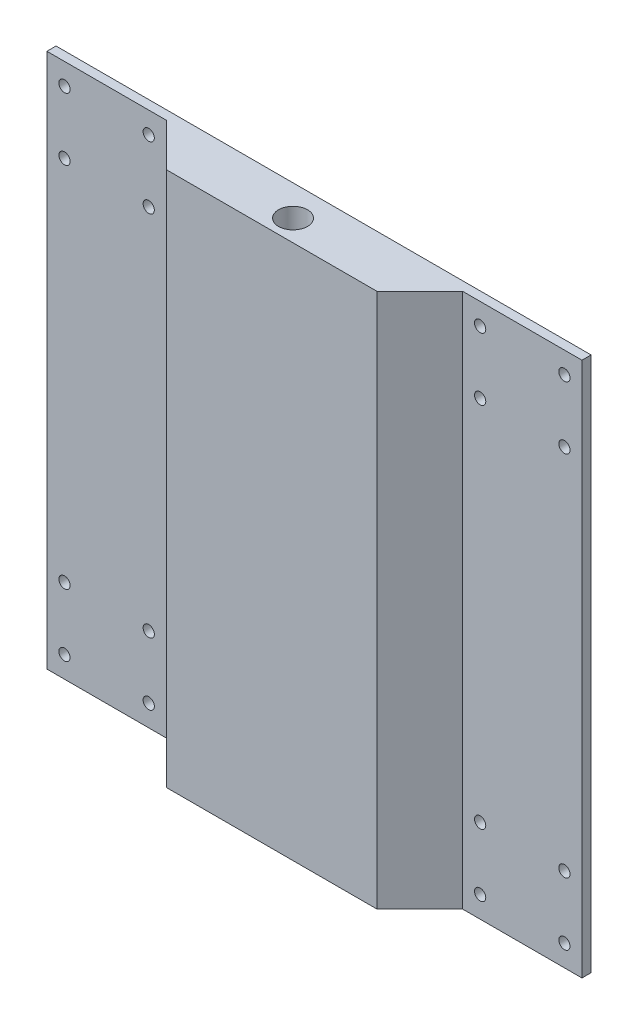
ISO-10303-21;
HEADER;
FILE_DESCRIPTION(('STEP AP214'),'2;1');
FILE_NAME('part.step','',(''),(''),'','','');
FILE_SCHEMA(('AUTOMOTIVE_DESIGN { 1 0 10303 214 1 1 1 1 }'));
ENDSEC;
DATA;
#1=APPLICATION_CONTEXT('core data for automotive mechanical design processes');
#2=APPLICATION_PROTOCOL_DEFINITION('international standard','automotive_design',2000,#1);
#3=PRODUCT_CONTEXT('',#1,'mechanical');
#4=PRODUCT('Part','Part','',(#3));
#5=PRODUCT_RELATED_PRODUCT_CATEGORY('part','',(#4));
#6=PRODUCT_DEFINITION_FORMATION('','',#4);
#7=PRODUCT_DEFINITION_CONTEXT('part definition',#1,'design');
#8=PRODUCT_DEFINITION('design','',#6,#7);
#9=PRODUCT_DEFINITION_SHAPE('','',#8);
#10=(LENGTH_UNIT() NAMED_UNIT(*) SI_UNIT(.MILLI.,.METRE.));
#11=(NAMED_UNIT(*) PLANE_ANGLE_UNIT() SI_UNIT($,.RADIAN.));
#12=(NAMED_UNIT(*) SI_UNIT($,.STERADIAN.) SOLID_ANGLE_UNIT());
#13=UNCERTAINTY_MEASURE_WITH_UNIT(LENGTH_MEASURE(1.E-05),#10,'distance_accuracy_value','');
#14=(GEOMETRIC_REPRESENTATION_CONTEXT(3) GLOBAL_UNCERTAINTY_ASSIGNED_CONTEXT((#13)) GLOBAL_UNIT_ASSIGNED_CONTEXT((#10,
#11,#12)) REPRESENTATION_CONTEXT('',''));
#15=CARTESIAN_POINT('',(0.,0.,0.));
#16=DIRECTION('',(0.,0.,1.));
#17=DIRECTION('',(1.,0.,0.));
#18=AXIS2_PLACEMENT_3D('',#15,#16,#17);
#19=CARTESIAN_POINT('',(0.,0.,2.6));
#20=DIRECTION('',(0.,0.,-1.));
#21=DIRECTION('',(-1.,0.,0.));
#22=AXIS2_PLACEMENT_3D('',#19,#20,#21);
#23=PLANE('',#22);
#24=CARTESIAN_POINT('',(147.4,128.5,2.6));
#25=DIRECTION('',(0.,0.,1.));
#26=DIRECTION('',(1.,0.,0.));
#27=AXIS2_PLACEMENT_3D('',#24,#25,#26);
#28=CIRCLE('',#27,1.59999999999999);
#29=CARTESIAN_POINT('',(149.,128.5,2.6));
#30=VERTEX_POINT('',#29);
#31=EDGE_CURVE('E286',#30,#30,#28,.T.);
#32=ORIENTED_EDGE('',*,*,#31,.F.);
#33=EDGE_LOOP('',(#32));
#34=FACE_BOUND('',#33,.T.);
#35=CARTESIAN_POINT('',(147.4,146.3,2.6));
#36=DIRECTION('',(0.,0.,-1.));
#37=DIRECTION('',(-1.,0.,0.));
#38=AXIS2_PLACEMENT_3D('',#35,#36,#37);
#39=CIRCLE('',#38,1.59999999999999);
#40=CARTESIAN_POINT('',(145.8,146.3,2.6));
#41=VERTEX_POINT('',#40);
#42=EDGE_CURVE('E254',#41,#41,#39,.T.);
#43=ORIENTED_EDGE('',*,*,#42,.T.);
#44=EDGE_LOOP('',(#43));
#45=FACE_BOUND('',#44,.T.);
#46=CARTESIAN_POINT('',(147.4,6.09999999999999,2.6));
#47=DIRECTION('',(0.,0.,1.));
#48=DIRECTION('',(1.,0.,0.));
#49=AXIS2_PLACEMENT_3D('',#46,#47,#48);
#50=CIRCLE('',#49,1.59999999999999);
#51=CARTESIAN_POINT('',(149.,6.09999999999999,2.6));
#52=VERTEX_POINT('',#51);
#53=EDGE_CURVE('E318',#52,#52,#50,.T.);
#54=ORIENTED_EDGE('',*,*,#53,.F.);
#55=EDGE_LOOP('',(#54));
#56=FACE_BOUND('',#55,.T.);
#57=CARTESIAN_POINT('',(147.4,23.8999999999999,2.6));
#58=DIRECTION('',(0.,0.,-1.));
#59=DIRECTION('',(-1.,0.,0.));
#60=AXIS2_PLACEMENT_3D('',#57,#58,#59);
#61=CIRCLE('',#60,1.59999999999999);
#62=CARTESIAN_POINT('',(145.8,23.8999999999999,2.6));
#63=VERTEX_POINT('',#62);
#64=EDGE_CURVE('E270',#63,#63,#61,.T.);
#65=ORIENTED_EDGE('',*,*,#64,.T.);
#66=EDGE_LOOP('',(#65));
#67=FACE_BOUND('',#66,.T.);
#68=DIRECTION('',(0.,1.,0.));
#69=VECTOR('',#68,1.);
#70=CARTESIAN_POINT('',(118.4,0.,2.6));
#71=LINE('',#70,#69);
#72=CARTESIAN_POINT('',(118.4,0.,2.6));
#73=VERTEX_POINT('',#72);
#74=CARTESIAN_POINT('',(118.4,152.4,2.6));
#75=VERTEX_POINT('',#74);
#76=EDGE_CURVE('E156',#73,#75,#71,.T.);
#77=ORIENTED_EDGE('',*,*,#76,.F.);
#78=DIRECTION('',(1.,0.,0.));
#79=VECTOR('',#78,1.);
#80=CARTESIAN_POINT('',(0.,0.,2.6));
#81=LINE('',#80,#79);
#82=CARTESIAN_POINT('',(152.4,0.,2.6));
#83=VERTEX_POINT('',#82);
#84=EDGE_CURVE('E139',#73,#83,#81,.T.);
#85=ORIENTED_EDGE('',*,*,#84,.T.);
#86=DIRECTION('',(0.,1.,0.));
#87=VECTOR('',#86,1.);
#88=CARTESIAN_POINT('',(152.4,0.,2.6));
#89=LINE('',#88,#87);
#90=CARTESIAN_POINT('',(152.4,152.4,2.6));
#91=VERTEX_POINT('',#90);
#92=EDGE_CURVE('E138',#83,#91,#89,.T.);
#93=ORIENTED_EDGE('',*,*,#92,.T.);
#94=DIRECTION('',(-1.,0.,0.));
#95=VECTOR('',#94,1.);
#96=CARTESIAN_POINT('',(0.,152.4,2.6));
#97=LINE('',#96,#95);
#98=EDGE_CURVE('E146',#91,#75,#97,.T.);
#99=ORIENTED_EDGE('',*,*,#98,.T.);
#100=EDGE_LOOP('',(#77,#85,#93,#99));
#101=FACE_BOUND('',#100,.T.);
#102=CARTESIAN_POINT('',(123.4,6.09999999999999,2.6));
#103=DIRECTION('',(0.,0.,-1.));
#104=DIRECTION('',(-1.,0.,0.));
#105=AXIS2_PLACEMENT_3D('',#102,#103,#104);
#106=CIRCLE('',#105,1.59999999999999);
#107=CARTESIAN_POINT('',(121.8,6.09999999999999,2.6));
#108=VERTEX_POINT('',#107);
#109=EDGE_CURVE('E310',#108,#108,#106,.T.);
#110=ORIENTED_EDGE('',*,*,#109,.T.);
#111=EDGE_LOOP('',(#110));
#112=FACE_BOUND('',#111,.T.);
#113=CARTESIAN_POINT('',(123.4,146.3,2.6));
#114=DIRECTION('',(0.,0.,1.));
#115=DIRECTION('',(1.,0.,0.));
#116=AXIS2_PLACEMENT_3D('',#113,#114,#115);
#117=CIRCLE('',#116,1.59999999999999);
#118=CARTESIAN_POINT('',(125.,146.3,2.6));
#119=VERTEX_POINT('',#118);
#120=EDGE_CURVE('E253',#119,#119,#117,.T.);
#121=ORIENTED_EDGE('',*,*,#120,.F.);
#122=EDGE_LOOP('',(#121));
#123=FACE_BOUND('',#122,.T.);
#124=CARTESIAN_POINT('',(123.4,128.5,2.6));
#125=DIRECTION('',(0.,0.,-1.));
#126=DIRECTION('',(-1.,0.,0.));
#127=AXIS2_PLACEMENT_3D('',#124,#125,#126);
#128=CIRCLE('',#127,1.59999999999999);
#129=CARTESIAN_POINT('',(121.8,128.5,2.6));
#130=VERTEX_POINT('',#129);
#131=EDGE_CURVE('E278',#130,#130,#128,.T.);
#132=ORIENTED_EDGE('',*,*,#131,.T.);
#133=EDGE_LOOP('',(#132));
#134=FACE_BOUND('',#133,.T.);
#135=CARTESIAN_POINT('',(123.4,23.9,2.6));
#136=DIRECTION('',(0.,0.,1.));
#137=DIRECTION('',(1.,0.,0.));
#138=AXIS2_PLACEMENT_3D('',#135,#136,#137);
#139=CIRCLE('',#138,1.59999999999998);
#140=CARTESIAN_POINT('',(125.,23.9,2.6));
#141=VERTEX_POINT('',#140);
#142=EDGE_CURVE('E269',#141,#141,#139,.T.);
#143=ORIENTED_EDGE('',*,*,#142,.F.);
#144=EDGE_LOOP('',(#143));
#145=FACE_BOUND('',#144,.T.);
#146=ADVANCED_FACE('F43',(#34,#45,#56,#67,#101,#112,#123,#134,#145),#23,.F.);
#147=CARTESIAN_POINT('',(29.,146.3,2.6));
#148=DIRECTION('',(0.,0.,1.));
#149=DIRECTION('',(1.,0.,0.));
#150=AXIS2_PLACEMENT_3D('',#147,#148,#149);
#151=CIRCLE('',#150,1.59999999999999);
#152=CARTESIAN_POINT('',(30.6,146.3,2.6));
#153=VERTEX_POINT('',#152);
#154=EDGE_CURVE('E229',#153,#153,#151,.F.);
#155=ORIENTED_EDGE('',*,*,#154,.T.);
#156=EDGE_LOOP('',(#155));
#157=FACE_BOUND('',#156,.T.);
#158=CARTESIAN_POINT('',(29.,128.5,2.6));
#159=DIRECTION('',(0.,0.,1.));
#160=DIRECTION('',(1.,0.,0.));
#161=AXIS2_PLACEMENT_3D('',#158,#159,#160);
#162=CIRCLE('',#161,1.59999999999999);
#163=CARTESIAN_POINT('',(30.6,128.5,2.6));
#164=VERTEX_POINT('',#163);
#165=EDGE_CURVE('E238',#164,#164,#162,.T.);
#166=ORIENTED_EDGE('',*,*,#165,.F.);
#167=EDGE_LOOP('',(#166));
#168=FACE_BOUND('',#167,.T.);
#169=CARTESIAN_POINT('',(4.99999999999995,6.10000000000005,2.6));
#170=DIRECTION('',(0.,0.,-1.));
#171=DIRECTION('',(-1.,0.,0.));
#172=AXIS2_PLACEMENT_3D('',#169,#170,#171);
#173=CIRCLE('',#172,1.59999999999999);
#174=CARTESIAN_POINT('',(3.39999999999996,6.10000000000005,2.6));
#175=VERTEX_POINT('',#174);
#176=EDGE_CURVE('E333',#175,#175,#173,.T.);
#177=ORIENTED_EDGE('',*,*,#176,.T.);
#178=EDGE_LOOP('',(#177));
#179=FACE_BOUND('',#178,.T.);
#180=CARTESIAN_POINT('',(4.99999999999996,23.9,2.6));
#181=DIRECTION('',(0.,0.,1.));
#182=DIRECTION('',(1.,0.,0.));
#183=AXIS2_PLACEMENT_3D('',#180,#181,#182);
#184=CIRCLE('',#183,1.59999999999999);
#185=CARTESIAN_POINT('',(6.59999999999995,23.9,2.6));
#186=VERTEX_POINT('',#185);
#187=EDGE_CURVE('E301',#186,#186,#184,.T.);
#188=ORIENTED_EDGE('',*,*,#187,.F.);
#189=EDGE_LOOP('',(#188));
#190=FACE_BOUND('',#189,.T.);
#191=CARTESIAN_POINT('',(5.,128.5,2.6));
#192=DIRECTION('',(0.,0.,1.));
#193=DIRECTION('',(1.,0.,0.));
#194=AXIS2_PLACEMENT_3D('',#191,#192,#193);
#195=CIRCLE('',#194,1.59999999999999);
#196=CARTESIAN_POINT('',(6.59999999999999,128.5,2.6));
#197=VERTEX_POINT('',#196);
#198=EDGE_CURVE('E225',#197,#197,#195,.F.);
#199=ORIENTED_EDGE('',*,*,#198,.T.);
#200=EDGE_LOOP('',(#199));
#201=FACE_BOUND('',#200,.T.);
#202=CARTESIAN_POINT('',(0.,0.,2.6));
#203=VERTEX_POINT('',#202);
#204=CARTESIAN_POINT('',(34.,0.,2.6));
#205=VERTEX_POINT('',#204);
#206=EDGE_CURVE('E96',#203,#205,#81,.T.);
#207=ORIENTED_EDGE('',*,*,#206,.T.);
#208=DIRECTION('',(0.,1.,0.));
#209=VECTOR('',#208,1.);
#210=CARTESIAN_POINT('',(34.,0.,2.6));
#211=LINE('',#210,#209);
#212=CARTESIAN_POINT('',(34.,152.4,2.6));
#213=VERTEX_POINT('',#212);
#214=EDGE_CURVE('E117',#205,#213,#211,.T.);
#215=ORIENTED_EDGE('',*,*,#214,.T.);
#216=CARTESIAN_POINT('',(0.,152.4,2.6));
#217=VERTEX_POINT('',#216);
#218=EDGE_CURVE('E67',#213,#217,#97,.T.);
#219=ORIENTED_EDGE('',*,*,#218,.T.);
#220=DIRECTION('',(0.,-1.,0.));
#221=VECTOR('',#220,1.);
#222=CARTESIAN_POINT('',(0.,0.,2.6));
#223=LINE('',#222,#221);
#224=EDGE_CURVE('E135',#217,#203,#223,.T.);
#225=ORIENTED_EDGE('',*,*,#224,.T.);
#226=EDGE_LOOP('',(#207,#215,#219,#225));
#227=FACE_BOUND('',#226,.T.);
#228=CARTESIAN_POINT('',(29.,23.9,2.6));
#229=DIRECTION('',(0.,0.,-1.));
#230=DIRECTION('',(-1.,0.,0.));
#231=AXIS2_PLACEMENT_3D('',#228,#229,#230);
#232=CIRCLE('',#231,1.6);
#233=CARTESIAN_POINT('',(27.4,23.9,2.6));
#234=VERTEX_POINT('',#233);
#235=EDGE_CURVE('E302',#234,#234,#232,.T.);
#236=ORIENTED_EDGE('',*,*,#235,.T.);
#237=EDGE_LOOP('',(#236));
#238=FACE_BOUND('',#237,.T.);
#239=CARTESIAN_POINT('',(28.9999999999999,6.10000000000002,2.6));
#240=DIRECTION('',(0.,0.,1.));
#241=DIRECTION('',(1.,0.,0.));
#242=AXIS2_PLACEMENT_3D('',#239,#240,#241);
#243=CIRCLE('',#242,1.59999999999999);
#244=CARTESIAN_POINT('',(30.5999999999999,6.10000000000002,2.6));
#245=VERTEX_POINT('',#244);
#246=EDGE_CURVE('E341',#245,#245,#243,.T.);
#247=ORIENTED_EDGE('',*,*,#246,.F.);
#248=EDGE_LOOP('',(#247));
#249=FACE_BOUND('',#248,.T.);
#250=CARTESIAN_POINT('',(5.,146.3,2.6));
#251=DIRECTION('',(0.,0.,1.));
#252=DIRECTION('',(1.,0.,0.));
#253=AXIS2_PLACEMENT_3D('',#250,#251,#252);
#254=CIRCLE('',#253,1.59999999999999);
#255=CARTESIAN_POINT('',(6.59999999999999,146.3,2.6));
#256=VERTEX_POINT('',#255);
#257=EDGE_CURVE('E237',#256,#256,#254,.T.);
#258=ORIENTED_EDGE('',*,*,#257,.F.);
#259=EDGE_LOOP('',(#258));
#260=FACE_BOUND('',#259,.T.);
#261=ADVANCED_FACE('F132',(#157,#168,#179,#190,#201,#227,#238,#249,#260),#23,.F.);
#262=CARTESIAN_POINT('',(0.,0.,0.));
#263=DIRECTION('',(0.,0.,-1.));
#264=DIRECTION('',(-1.,0.,0.));
#265=AXIS2_PLACEMENT_3D('',#262,#263,#264);
#266=PLANE('',#265);
#267=CARTESIAN_POINT('',(123.4,128.5,0.));
#268=DIRECTION('',(0.,0.,-1.));
#269=DIRECTION('',(-1.,0.,0.));
#270=AXIS2_PLACEMENT_3D('',#267,#268,#269);
#271=CIRCLE('',#270,1.59999999999999);
#272=CARTESIAN_POINT('',(121.8,128.5,0.));
#273=VERTEX_POINT('',#272);
#274=EDGE_CURVE('E274',#273,#273,#271,.T.);
#275=ORIENTED_EDGE('',*,*,#274,.F.);
#276=EDGE_LOOP('',(#275));
#277=FACE_BOUND('',#276,.T.);
#278=CARTESIAN_POINT('',(147.4,146.3,0.));
#279=DIRECTION('',(0.,0.,-1.));
#280=DIRECTION('',(-1.,0.,0.));
#281=AXIS2_PLACEMENT_3D('',#278,#279,#280);
#282=CIRCLE('',#281,1.59999999999999);
#283=CARTESIAN_POINT('',(145.8,146.3,0.));
#284=VERTEX_POINT('',#283);
#285=EDGE_CURVE('E290',#284,#284,#282,.T.);
#286=ORIENTED_EDGE('',*,*,#285,.F.);
#287=EDGE_LOOP('',(#286));
#288=FACE_BOUND('',#287,.T.);
#289=CARTESIAN_POINT('',(29.,146.3,0.));
#290=DIRECTION('',(0.,0.,1.));
#291=DIRECTION('',(1.,0.,0.));
#292=AXIS2_PLACEMENT_3D('',#289,#290,#291);
#293=CIRCLE('',#292,1.59999999999999);
#294=CARTESIAN_POINT('',(30.6,146.3,0.));
#295=VERTEX_POINT('',#294);
#296=EDGE_CURVE('E242',#295,#295,#293,.F.);
#297=ORIENTED_EDGE('',*,*,#296,.F.);
#298=EDGE_LOOP('',(#297));
#299=FACE_BOUND('',#298,.T.);
#300=CARTESIAN_POINT('',(4.99999999999995,6.10000000000005,0.));
#301=DIRECTION('',(0.,0.,-1.));
#302=DIRECTION('',(-1.,0.,0.));
#303=AXIS2_PLACEMENT_3D('',#300,#301,#302);
#304=CIRCLE('',#303,1.59999999999999);
#305=CARTESIAN_POINT('',(3.39999999999996,6.10000000000005,0.));
#306=VERTEX_POINT('',#305);
#307=EDGE_CURVE('E329',#306,#306,#304,.T.);
#308=ORIENTED_EDGE('',*,*,#307,.F.);
#309=EDGE_LOOP('',(#308));
#310=FACE_BOUND('',#309,.T.);
#311=CARTESIAN_POINT('',(29.,23.9,0.));
#312=DIRECTION('',(0.,0.,-1.));
#313=DIRECTION('',(-1.,0.,0.));
#314=AXIS2_PLACEMENT_3D('',#311,#312,#313);
#315=CIRCLE('',#314,1.6);
#316=CARTESIAN_POINT('',(27.4,23.9,0.));
#317=VERTEX_POINT('',#316);
#318=EDGE_CURVE('E345',#317,#317,#315,.T.);
#319=ORIENTED_EDGE('',*,*,#318,.F.);
#320=EDGE_LOOP('',(#319));
#321=FACE_BOUND('',#320,.T.);
#322=CARTESIAN_POINT('',(123.4,6.09999999999999,0.));
#323=DIRECTION('',(0.,0.,-1.));
#324=DIRECTION('',(-1.,0.,0.));
#325=AXIS2_PLACEMENT_3D('',#322,#323,#324);
#326=CIRCLE('',#325,1.59999999999999);
#327=CARTESIAN_POINT('',(121.8,6.09999999999999,0.));
#328=VERTEX_POINT('',#327);
#329=EDGE_CURVE('E306',#328,#328,#326,.T.);
#330=ORIENTED_EDGE('',*,*,#329,.F.);
#331=EDGE_LOOP('',(#330));
#332=FACE_BOUND('',#331,.T.);
#333=CARTESIAN_POINT('',(147.4,23.8999999999999,0.));
#334=DIRECTION('',(0.,0.,-1.));
#335=DIRECTION('',(-1.,0.,0.));
#336=AXIS2_PLACEMENT_3D('',#333,#334,#335);
#337=CIRCLE('',#336,1.59999999999999);
#338=CARTESIAN_POINT('',(145.8,23.8999999999999,0.));
#339=VERTEX_POINT('',#338);
#340=EDGE_CURVE('E322',#339,#339,#337,.T.);
#341=ORIENTED_EDGE('',*,*,#340,.F.);
#342=EDGE_LOOP('',(#341));
#343=FACE_BOUND('',#342,.T.);
#344=CARTESIAN_POINT('',(5.,128.5,0.));
#345=DIRECTION('',(0.,0.,1.));
#346=DIRECTION('',(1.,0.,0.));
#347=AXIS2_PLACEMENT_3D('',#344,#345,#346);
#348=CIRCLE('',#347,1.59999999999999);
#349=CARTESIAN_POINT('',(6.59999999999999,128.5,0.));
#350=VERTEX_POINT('',#349);
#351=EDGE_CURVE('E224',#350,#350,#348,.F.);
#352=ORIENTED_EDGE('',*,*,#351,.F.);
#353=EDGE_LOOP('',(#352));
#354=FACE_BOUND('',#353,.T.);
#355=DIRECTION('',(0.,-1.,0.));
#356=VECTOR('',#355,1.);
#357=CARTESIAN_POINT('',(0.,0.,0.));
#358=LINE('',#357,#356);
#359=CARTESIAN_POINT('',(0.,152.4,0.));
#360=VERTEX_POINT('',#359);
#361=CARTESIAN_POINT('',(0.,0.,0.));
#362=VERTEX_POINT('',#361);
#363=EDGE_CURVE('E151',#360,#362,#358,.T.);
#364=ORIENTED_EDGE('',*,*,#363,.F.);
#365=DIRECTION('',(-1.,0.,0.));
#366=VECTOR('',#365,1.);
#367=CARTESIAN_POINT('',(0.,152.4,0.));
#368=LINE('',#367,#366);
#369=CARTESIAN_POINT('',(152.4,152.4,0.));
#370=VERTEX_POINT('',#369);
#371=EDGE_CURVE('E89',#370,#360,#368,.T.);
#372=ORIENTED_EDGE('',*,*,#371,.F.);
#373=DIRECTION('',(0.,1.,0.));
#374=VECTOR('',#373,1.);
#375=CARTESIAN_POINT('',(152.4,0.,0.));
#376=LINE('',#375,#374);
#377=CARTESIAN_POINT('',(152.4,0.,0.));
#378=VERTEX_POINT('',#377);
#379=EDGE_CURVE('E159',#378,#370,#376,.T.);
#380=ORIENTED_EDGE('',*,*,#379,.F.);
#381=DIRECTION('',(1.,0.,0.));
#382=VECTOR('',#381,1.);
#383=CARTESIAN_POINT('',(0.,0.,0.));
#384=LINE('',#383,#382);
#385=EDGE_CURVE('E155',#362,#378,#384,.T.);
#386=ORIENTED_EDGE('',*,*,#385,.F.);
#387=EDGE_LOOP('',(#364,#372,#380,#386));
#388=FACE_BOUND('',#387,.T.);
#389=CARTESIAN_POINT('',(147.4,6.09999999999999,0.));
#390=DIRECTION('',(0.,0.,1.));
#391=DIRECTION('',(1.,0.,0.));
#392=AXIS2_PLACEMENT_3D('',#389,#390,#391);
#393=CIRCLE('',#392,1.59999999999999);
#394=CARTESIAN_POINT('',(149.,6.09999999999999,0.));
#395=VERTEX_POINT('',#394);
#396=EDGE_CURVE('E314',#395,#395,#393,.T.);
#397=ORIENTED_EDGE('',*,*,#396,.T.);
#398=EDGE_LOOP('',(#397));
#399=FACE_BOUND('',#398,.T.);
#400=CARTESIAN_POINT('',(4.99999999999996,23.9,0.));
#401=DIRECTION('',(0.,0.,1.));
#402=DIRECTION('',(1.,0.,0.));
#403=AXIS2_PLACEMENT_3D('',#400,#401,#402);
#404=CIRCLE('',#403,1.59999999999999);
#405=CARTESIAN_POINT('',(6.59999999999995,23.9,0.));
#406=VERTEX_POINT('',#405);
#407=EDGE_CURVE('E297',#406,#406,#404,.T.);
#408=ORIENTED_EDGE('',*,*,#407,.T.);
#409=EDGE_LOOP('',(#408));
#410=FACE_BOUND('',#409,.T.);
#411=CARTESIAN_POINT('',(28.9999999999999,6.10000000000002,0.));
#412=DIRECTION('',(0.,0.,1.));
#413=DIRECTION('',(1.,0.,0.));
#414=AXIS2_PLACEMENT_3D('',#411,#412,#413);
#415=CIRCLE('',#414,1.59999999999999);
#416=CARTESIAN_POINT('',(30.5999999999999,6.10000000000002,0.));
#417=VERTEX_POINT('',#416);
#418=EDGE_CURVE('E337',#417,#417,#415,.T.);
#419=ORIENTED_EDGE('',*,*,#418,.T.);
#420=EDGE_LOOP('',(#419));
#421=FACE_BOUND('',#420,.T.);
#422=CARTESIAN_POINT('',(123.4,146.3,0.));
#423=DIRECTION('',(0.,0.,1.));
#424=DIRECTION('',(1.,0.,0.));
#425=AXIS2_PLACEMENT_3D('',#422,#423,#424);
#426=CIRCLE('',#425,1.59999999999999);
#427=CARTESIAN_POINT('',(125.,146.3,0.));
#428=VERTEX_POINT('',#427);
#429=EDGE_CURVE('E249',#428,#428,#426,.T.);
#430=ORIENTED_EDGE('',*,*,#429,.T.);
#431=EDGE_LOOP('',(#430));
#432=FACE_BOUND('',#431,.T.);
#433=CARTESIAN_POINT('',(29.,128.5,0.));
#434=DIRECTION('',(0.,0.,1.));
#435=DIRECTION('',(1.,0.,0.));
#436=AXIS2_PLACEMENT_3D('',#433,#434,#435);
#437=CIRCLE('',#436,1.59999999999999);
#438=CARTESIAN_POINT('',(30.6,128.5,0.));
#439=VERTEX_POINT('',#438);
#440=EDGE_CURVE('E258',#439,#439,#437,.T.);
#441=ORIENTED_EDGE('',*,*,#440,.T.);
#442=EDGE_LOOP('',(#441));
#443=FACE_BOUND('',#442,.T.);
#444=CARTESIAN_POINT('',(5.,146.3,0.));
#445=DIRECTION('',(0.,0.,1.));
#446=DIRECTION('',(1.,0.,0.));
#447=AXIS2_PLACEMENT_3D('',#444,#445,#446);
#448=CIRCLE('',#447,1.59999999999999);
#449=CARTESIAN_POINT('',(6.59999999999999,146.3,0.));
#450=VERTEX_POINT('',#449);
#451=EDGE_CURVE('E233',#450,#450,#448,.T.);
#452=ORIENTED_EDGE('',*,*,#451,.T.);
#453=EDGE_LOOP('',(#452));
#454=FACE_BOUND('',#453,.T.);
#455=CARTESIAN_POINT('',(147.4,128.5,0.));
#456=DIRECTION('',(0.,0.,1.));
#457=DIRECTION('',(1.,0.,0.));
#458=AXIS2_PLACEMENT_3D('',#455,#456,#457);
#459=CIRCLE('',#458,1.59999999999999);
#460=CARTESIAN_POINT('',(149.,128.5,0.));
#461=VERTEX_POINT('',#460);
#462=EDGE_CURVE('E282',#461,#461,#459,.T.);
#463=ORIENTED_EDGE('',*,*,#462,.T.);
#464=EDGE_LOOP('',(#463));
#465=FACE_BOUND('',#464,.T.);
#466=CARTESIAN_POINT('',(123.4,23.9,0.));
#467=DIRECTION('',(0.,0.,1.));
#468=DIRECTION('',(1.,0.,0.));
#469=AXIS2_PLACEMENT_3D('',#466,#467,#468);
#470=CIRCLE('',#469,1.59999999999998);
#471=CARTESIAN_POINT('',(125.,23.9,0.));
#472=VERTEX_POINT('',#471);
#473=EDGE_CURVE('E265',#472,#472,#470,.T.);
#474=ORIENTED_EDGE('',*,*,#473,.T.);
#475=EDGE_LOOP('',(#474));
#476=FACE_BOUND('',#475,.T.);
#477=ADVANCED_FACE('F179',(#277,#288,#299,#310,#321,#332,#343,#354,#388,#399,#410,#421,#432,
#443,#454,#465,#476),#266,.T.);
#478=CARTESIAN_POINT('',(0.,152.4,2.6));
#479=DIRECTION('',(0.,-1.,0.));
#480=DIRECTION('',(0.,0.,-1.));
#481=AXIS2_PLACEMENT_3D('',#478,#479,#480);
#482=PLANE('',#481);
#483=ORIENTED_EDGE('',*,*,#371,.T.);
#484=DIRECTION('',(0.,0.,-1.));
#485=VECTOR('',#484,1.);
#486=CARTESIAN_POINT('',(0.,152.4,2.6));
#487=LINE('',#486,#485);
#488=EDGE_CURVE('E150',#217,#360,#487,.T.);
#489=ORIENTED_EDGE('',*,*,#488,.F.);
#490=ORIENTED_EDGE('',*,*,#218,.F.);
#491=DIRECTION('',(0.707106781186546,0.,0.707106781186549));
#492=VECTOR('',#491,1.);
#493=CARTESIAN_POINT('',(34.,152.4,2.6));
#494=LINE('',#493,#492);
#495=CARTESIAN_POINT('',(46.2,152.4,14.8000000000001));
#496=VERTEX_POINT('',#495);
#497=EDGE_CURVE('E59',#213,#496,#494,.T.);
#498=ORIENTED_EDGE('',*,*,#497,.T.);
#499=DIRECTION('',(1.,0.,0.));
#500=VECTOR('',#499,1.);
#501=CARTESIAN_POINT('',(46.2,152.4,14.8000000000001));
#502=LINE('',#501,#500);
#503=CARTESIAN_POINT('',(106.2,152.4,14.8000000000001));
#504=VERTEX_POINT('',#503);
#505=EDGE_CURVE('E188',#496,#504,#502,.T.);
#506=ORIENTED_EDGE('',*,*,#505,.T.);
#507=DIRECTION('',(0.707106781186546,0.,-0.707106781186549));
#508=VECTOR('',#507,1.);
#509=CARTESIAN_POINT('',(106.2,152.4,14.8000000000001));
#510=LINE('',#509,#508);
#511=EDGE_CURVE('E130',#504,#75,#510,.T.);
#512=ORIENTED_EDGE('',*,*,#511,.T.);
#513=ORIENTED_EDGE('',*,*,#98,.F.);
#514=DIRECTION('',(0.,0.,-1.));
#515=VECTOR('',#514,1.);
#516=CARTESIAN_POINT('',(152.4,152.4,2.6));
#517=LINE('',#516,#515);
#518=EDGE_CURVE('E166',#91,#370,#517,.T.);
#519=ORIENTED_EDGE('',*,*,#518,.T.);
#520=EDGE_LOOP('',(#483,#489,#490,#498,#506,#512,#513,#519));
#521=FACE_BOUND('',#520,.T.);
#522=CARTESIAN_POINT('',(76.2,152.4,8.70000000000003));
#523=DIRECTION('',(0.,1.,0.));
#524=DIRECTION('',(0.,0.,1.));
#525=AXIS2_PLACEMENT_3D('',#522,#523,#524);
#526=CIRCLE('',#525,4.12499999999999);
#527=CARTESIAN_POINT('',(76.2,152.4,12.825));
#528=VERTEX_POINT('',#527);
#529=EDGE_CURVE('E197',#528,#528,#526,.T.);
#530=ORIENTED_EDGE('',*,*,#529,.F.);
#531=EDGE_LOOP('',(#530));
#532=FACE_BOUND('',#531,.T.);
#533=ADVANCED_FACE('F182',(#521,#532),#482,.F.);
#534=CARTESIAN_POINT('',(0.,0.,2.6));
#535=DIRECTION('',(1.,0.,0.));
#536=DIRECTION('',(0.,0.,-1.));
#537=AXIS2_PLACEMENT_3D('',#534,#535,#536);
#538=PLANE('',#537);
#539=ORIENTED_EDGE('',*,*,#363,.T.);
#540=DIRECTION('',(0.,0.,-1.));
#541=VECTOR('',#540,1.);
#542=CARTESIAN_POINT('',(0.,0.,2.6));
#543=LINE('',#542,#541);
#544=EDGE_CURVE('E11',#203,#362,#543,.T.);
#545=ORIENTED_EDGE('',*,*,#544,.F.);
#546=ORIENTED_EDGE('',*,*,#224,.F.);
#547=ORIENTED_EDGE('',*,*,#488,.T.);
#548=EDGE_LOOP('',(#539,#545,#546,#547));
#549=FACE_BOUND('',#548,.T.);
#550=ADVANCED_FACE('F45',(#549),#538,.F.);
#551=CARTESIAN_POINT('',(0.,0.,2.6));
#552=DIRECTION('',(0.,1.,0.));
#553=DIRECTION('',(0.,0.,1.));
#554=AXIS2_PLACEMENT_3D('',#551,#552,#553);
#555=PLANE('',#554);
#556=CARTESIAN_POINT('',(76.2,0.,8.70000000000003));
#557=DIRECTION('',(0.,1.,0.));
#558=DIRECTION('',(0.,0.,1.));
#559=AXIS2_PLACEMENT_3D('',#556,#557,#558);
#560=CIRCLE('',#559,4.12499999999998);
#561=CARTESIAN_POINT('',(76.2,0.,12.825));
#562=VERTEX_POINT('',#561);
#563=EDGE_CURVE('E191',#562,#562,#560,.T.);
#564=ORIENTED_EDGE('',*,*,#563,.T.);
#565=EDGE_LOOP('',(#564));
#566=FACE_BOUND('',#565,.T.);
#567=ORIENTED_EDGE('',*,*,#385,.T.);
#568=DIRECTION('',(0.,0.,-1.));
#569=VECTOR('',#568,1.);
#570=CARTESIAN_POINT('',(152.4,0.,2.6));
#571=LINE('',#570,#569);
#572=EDGE_CURVE('E52',#83,#378,#571,.T.);
#573=ORIENTED_EDGE('',*,*,#572,.F.);
#574=ORIENTED_EDGE('',*,*,#84,.F.);
#575=DIRECTION('',(0.707106781186546,0.,-0.707106781186549));
#576=VECTOR('',#575,1.);
#577=CARTESIAN_POINT('',(106.2,0.,14.8000000000001));
#578=LINE('',#577,#576);
#579=CARTESIAN_POINT('',(106.2,0.,14.8000000000001));
#580=VERTEX_POINT('',#579);
#581=EDGE_CURVE('E122',#580,#73,#578,.T.);
#582=ORIENTED_EDGE('',*,*,#581,.F.);
#583=DIRECTION('',(1.,0.,0.));
#584=VECTOR('',#583,1.);
#585=CARTESIAN_POINT('',(46.2,0.,14.8000000000001));
#586=LINE('',#585,#584);
#587=CARTESIAN_POINT('',(46.2,0.,14.8000000000001));
#588=VERTEX_POINT('',#587);
#589=EDGE_CURVE('E128',#588,#580,#586,.T.);
#590=ORIENTED_EDGE('',*,*,#589,.F.);
#591=DIRECTION('',(0.707106781186546,0.,0.707106781186549));
#592=VECTOR('',#591,1.);
#593=CARTESIAN_POINT('',(34.,0.,2.6));
#594=LINE('',#593,#592);
#595=EDGE_CURVE('E119',#205,#588,#594,.T.);
#596=ORIENTED_EDGE('',*,*,#595,.F.);
#597=ORIENTED_EDGE('',*,*,#206,.F.);
#598=ORIENTED_EDGE('',*,*,#544,.T.);
#599=EDGE_LOOP('',(#567,#573,#574,#582,#590,#596,#597,#598));
#600=FACE_BOUND('',#599,.T.);
#601=ADVANCED_FACE('F125',(#566,#600),#555,.F.);
#602=CARTESIAN_POINT('',(152.4,0.,2.6));
#603=DIRECTION('',(-1.,0.,0.));
#604=DIRECTION('',(0.,0.,1.));
#605=AXIS2_PLACEMENT_3D('',#602,#603,#604);
#606=PLANE('',#605);
#607=ORIENTED_EDGE('',*,*,#379,.T.);
#608=ORIENTED_EDGE('',*,*,#518,.F.);
#609=ORIENTED_EDGE('',*,*,#92,.F.);
#610=ORIENTED_EDGE('',*,*,#572,.T.);
#611=EDGE_LOOP('',(#607,#608,#609,#610));
#612=FACE_BOUND('',#611,.T.);
#613=ADVANCED_FACE('F174',(#612),#606,.F.);
#614=CARTESIAN_POINT('',(106.2,0.,14.8000000000001));
#615=DIRECTION('',(0.707106781186549,0.,0.707106781186546));
#616=DIRECTION('',(0.707106781186546,0.,-0.707106781186549));
#617=AXIS2_PLACEMENT_3D('',#614,#615,#616);
#618=PLANE('',#617);
#619=ORIENTED_EDGE('',*,*,#511,.F.);
#620=DIRECTION('',(0.,1.,0.));
#621=VECTOR('',#620,1.);
#622=CARTESIAN_POINT('',(106.2,0.,14.8000000000001));
#623=LINE('',#622,#621);
#624=EDGE_CURVE('E206',#580,#504,#623,.T.);
#625=ORIENTED_EDGE('',*,*,#624,.F.);
#626=ORIENTED_EDGE('',*,*,#581,.T.);
#627=ORIENTED_EDGE('',*,*,#76,.T.);
#628=EDGE_LOOP('',(#619,#625,#626,#627));
#629=FACE_BOUND('',#628,.T.);
#630=ADVANCED_FACE('F213',(#629),#618,.T.);
#631=CARTESIAN_POINT('',(46.2,0.,14.8000000000001));
#632=DIRECTION('',(0.,0.,1.));
#633=DIRECTION('',(1.,0.,0.));
#634=AXIS2_PLACEMENT_3D('',#631,#632,#633);
#635=PLANE('',#634);
#636=ORIENTED_EDGE('',*,*,#505,.F.);
#637=DIRECTION('',(0.,1.,0.));
#638=VECTOR('',#637,1.);
#639=CARTESIAN_POINT('',(46.2,0.,14.8000000000001));
#640=LINE('',#639,#638);
#641=EDGE_CURVE('E121',#588,#496,#640,.T.);
#642=ORIENTED_EDGE('',*,*,#641,.F.);
#643=ORIENTED_EDGE('',*,*,#589,.T.);
#644=ORIENTED_EDGE('',*,*,#624,.T.);
#645=EDGE_LOOP('',(#636,#642,#643,#644));
#646=FACE_BOUND('',#645,.T.);
#647=ADVANCED_FACE('F211',(#646),#635,.T.);
#648=CARTESIAN_POINT('',(34.,0.,2.6));
#649=DIRECTION('',(-0.707106781186549,0.,0.707106781186546));
#650=DIRECTION('',(0.707106781186546,0.,0.707106781186549));
#651=AXIS2_PLACEMENT_3D('',#648,#649,#650);
#652=PLANE('',#651);
#653=ORIENTED_EDGE('',*,*,#497,.F.);
#654=ORIENTED_EDGE('',*,*,#214,.F.);
#655=ORIENTED_EDGE('',*,*,#595,.T.);
#656=ORIENTED_EDGE('',*,*,#641,.T.);
#657=EDGE_LOOP('',(#653,#654,#655,#656));
#658=FACE_BOUND('',#657,.T.);
#659=ADVANCED_FACE('F118',(#658),#652,.T.);
#660=CARTESIAN_POINT('',(76.2,152.4,8.70000000000003));
#661=DIRECTION('',(0.,1.,0.));
#662=DIRECTION('',(0.,0.,1.));
#663=AXIS2_PLACEMENT_3D('',#660,#661,#662);
#664=CYLINDRICAL_SURFACE('',#663,4.12499999999998);
#665=ORIENTED_EDGE('',*,*,#563,.F.);
#666=EDGE_LOOP('',(#665));
#667=FACE_BOUND('',#666,.T.);
#668=ORIENTED_EDGE('',*,*,#529,.T.);
#669=EDGE_LOOP('',(#668));
#670=FACE_BOUND('',#669,.T.);
#671=ADVANCED_FACE('F395',(#667,#670),#664,.F.);
#672=CARTESIAN_POINT('',(5.,128.5,0.));
#673=DIRECTION('',(0.,0.,1.));
#674=DIRECTION('',(1.,0.,0.));
#675=AXIS2_PLACEMENT_3D('',#672,#673,#674);
#676=CYLINDRICAL_SURFACE('',#675,1.59999999999999);
#677=ORIENTED_EDGE('',*,*,#351,.T.);
#678=EDGE_LOOP('',(#677));
#679=FACE_BOUND('',#678,.T.);
#680=ORIENTED_EDGE('',*,*,#198,.F.);
#681=EDGE_LOOP('',(#680));
#682=FACE_BOUND('',#681,.T.);
#683=ADVANCED_FACE('F398',(#679,#682),#676,.F.);
#684=CARTESIAN_POINT('',(147.4,23.8999999999999,0.));
#685=DIRECTION('',(0.,0.,1.));
#686=DIRECTION('',(1.,0.,0.));
#687=AXIS2_PLACEMENT_3D('',#684,#685,#686);
#688=CYLINDRICAL_SURFACE('',#687,1.59999999999999);
#689=ORIENTED_EDGE('',*,*,#340,.T.);
#690=EDGE_LOOP('',(#689));
#691=FACE_BOUND('',#690,.T.);
#692=ORIENTED_EDGE('',*,*,#64,.F.);
#693=EDGE_LOOP('',(#692));
#694=FACE_BOUND('',#693,.T.);
#695=ADVANCED_FACE('F405',(#691,#694),#688,.F.);
#696=CARTESIAN_POINT('',(147.4,6.09999999999999,0.));
#697=DIRECTION('',(0.,0.,1.));
#698=DIRECTION('',(1.,0.,0.));
#699=AXIS2_PLACEMENT_3D('',#696,#697,#698);
#700=CYLINDRICAL_SURFACE('',#699,1.59999999999999);
#701=ORIENTED_EDGE('',*,*,#396,.F.);
#702=EDGE_LOOP('',(#701));
#703=FACE_BOUND('',#702,.T.);
#704=ORIENTED_EDGE('',*,*,#53,.T.);
#705=EDGE_LOOP('',(#704));
#706=FACE_BOUND('',#705,.T.);
#707=ADVANCED_FACE('F475',(#703,#706),#700,.F.);
#708=CARTESIAN_POINT('',(123.4,6.09999999999999,0.));
#709=DIRECTION('',(0.,0.,1.));
#710=DIRECTION('',(1.,0.,0.));
#711=AXIS2_PLACEMENT_3D('',#708,#709,#710);
#712=CYLINDRICAL_SURFACE('',#711,1.59999999999999);
#713=ORIENTED_EDGE('',*,*,#329,.T.);
#714=EDGE_LOOP('',(#713));
#715=FACE_BOUND('',#714,.T.);
#716=ORIENTED_EDGE('',*,*,#109,.F.);
#717=EDGE_LOOP('',(#716));
#718=FACE_BOUND('',#717,.T.);
#719=ADVANCED_FACE('F367',(#715,#718),#712,.F.);
#720=CARTESIAN_POINT('',(4.99999999999996,23.9,0.));
#721=DIRECTION('',(0.,0.,1.));
#722=DIRECTION('',(1.,0.,0.));
#723=AXIS2_PLACEMENT_3D('',#720,#721,#722);
#724=CYLINDRICAL_SURFACE('',#723,1.59999999999999);
#725=ORIENTED_EDGE('',*,*,#407,.F.);
#726=EDGE_LOOP('',(#725));
#727=FACE_BOUND('',#726,.T.);
#728=ORIENTED_EDGE('',*,*,#187,.T.);
#729=EDGE_LOOP('',(#728));
#730=FACE_BOUND('',#729,.T.);
#731=ADVANCED_FACE('F357',(#727,#730),#724,.F.);
#732=CARTESIAN_POINT('',(29.,23.9,0.));
#733=DIRECTION('',(0.,0.,1.));
#734=DIRECTION('',(1.,0.,0.));
#735=AXIS2_PLACEMENT_3D('',#732,#733,#734);
#736=CYLINDRICAL_SURFACE('',#735,1.6);
#737=ORIENTED_EDGE('',*,*,#318,.T.);
#738=EDGE_LOOP('',(#737));
#739=FACE_BOUND('',#738,.T.);
#740=ORIENTED_EDGE('',*,*,#235,.F.);
#741=EDGE_LOOP('',(#740));
#742=FACE_BOUND('',#741,.T.);
#743=ADVANCED_FACE('F354',(#739,#742),#736,.F.);
#744=CARTESIAN_POINT('',(28.9999999999999,6.10000000000002,0.));
#745=DIRECTION('',(0.,0.,1.));
#746=DIRECTION('',(1.,0.,0.));
#747=AXIS2_PLACEMENT_3D('',#744,#745,#746);
#748=CYLINDRICAL_SURFACE('',#747,1.59999999999999);
#749=ORIENTED_EDGE('',*,*,#418,.F.);
#750=EDGE_LOOP('',(#749));
#751=FACE_BOUND('',#750,.T.);
#752=ORIENTED_EDGE('',*,*,#246,.T.);
#753=EDGE_LOOP('',(#752));
#754=FACE_BOUND('',#753,.T.);
#755=ADVANCED_FACE('F356',(#751,#754),#748,.F.);
#756=CARTESIAN_POINT('',(4.99999999999995,6.10000000000005,0.));
#757=DIRECTION('',(0.,0.,1.));
#758=DIRECTION('',(1.,0.,0.));
#759=AXIS2_PLACEMENT_3D('',#756,#757,#758);
#760=CYLINDRICAL_SURFACE('',#759,1.59999999999999);
#761=ORIENTED_EDGE('',*,*,#307,.T.);
#762=EDGE_LOOP('',(#761));
#763=FACE_BOUND('',#762,.T.);
#764=ORIENTED_EDGE('',*,*,#176,.F.);
#765=EDGE_LOOP('',(#764));
#766=FACE_BOUND('',#765,.T.);
#767=ADVANCED_FACE('F364',(#763,#766),#760,.F.);
#768=CARTESIAN_POINT('',(123.4,146.3,0.));
#769=DIRECTION('',(0.,0.,1.));
#770=DIRECTION('',(1.,0.,0.));
#771=AXIS2_PLACEMENT_3D('',#768,#769,#770);
#772=CYLINDRICAL_SURFACE('',#771,1.59999999999999);
#773=ORIENTED_EDGE('',*,*,#429,.F.);
#774=EDGE_LOOP('',(#773));
#775=FACE_BOUND('',#774,.T.);
#776=ORIENTED_EDGE('',*,*,#120,.T.);
#777=EDGE_LOOP('',(#776));
#778=FACE_BOUND('',#777,.T.);
#779=ADVANCED_FACE('F525',(#775,#778),#772,.F.);
#780=CARTESIAN_POINT('',(29.,128.5,0.));
#781=DIRECTION('',(0.,0.,1.));
#782=DIRECTION('',(1.,0.,0.));
#783=AXIS2_PLACEMENT_3D('',#780,#781,#782);
#784=CYLINDRICAL_SURFACE('',#783,1.59999999999999);
#785=ORIENTED_EDGE('',*,*,#440,.F.);
#786=EDGE_LOOP('',(#785));
#787=FACE_BOUND('',#786,.T.);
#788=ORIENTED_EDGE('',*,*,#165,.T.);
#789=EDGE_LOOP('',(#788));
#790=FACE_BOUND('',#789,.T.);
#791=ADVANCED_FACE('F536',(#787,#790),#784,.F.);
#792=CARTESIAN_POINT('',(5.,146.3,0.));
#793=DIRECTION('',(0.,0.,1.));
#794=DIRECTION('',(1.,0.,0.));
#795=AXIS2_PLACEMENT_3D('',#792,#793,#794);
#796=CYLINDRICAL_SURFACE('',#795,1.59999999999999);
#797=ORIENTED_EDGE('',*,*,#451,.F.);
#798=EDGE_LOOP('',(#797));
#799=FACE_BOUND('',#798,.T.);
#800=ORIENTED_EDGE('',*,*,#257,.T.);
#801=EDGE_LOOP('',(#800));
#802=FACE_BOUND('',#801,.T.);
#803=ADVANCED_FACE('F547',(#799,#802),#796,.F.);
#804=CARTESIAN_POINT('',(29.,146.3,0.));
#805=DIRECTION('',(0.,0.,1.));
#806=DIRECTION('',(1.,0.,0.));
#807=AXIS2_PLACEMENT_3D('',#804,#805,#806);
#808=CYLINDRICAL_SURFACE('',#807,1.59999999999999);
#809=ORIENTED_EDGE('',*,*,#296,.T.);
#810=EDGE_LOOP('',(#809));
#811=FACE_BOUND('',#810,.T.);
#812=ORIENTED_EDGE('',*,*,#154,.F.);
#813=EDGE_LOOP('',(#812));
#814=FACE_BOUND('',#813,.T.);
#815=ADVANCED_FACE('F558',(#811,#814),#808,.F.);
#816=CARTESIAN_POINT('',(147.4,146.3,0.));
#817=DIRECTION('',(0.,0.,1.));
#818=DIRECTION('',(1.,0.,0.));
#819=AXIS2_PLACEMENT_3D('',#816,#817,#818);
#820=CYLINDRICAL_SURFACE('',#819,1.59999999999999);
#821=ORIENTED_EDGE('',*,*,#285,.T.);
#822=EDGE_LOOP('',(#821));
#823=FACE_BOUND('',#822,.T.);
#824=ORIENTED_EDGE('',*,*,#42,.F.);
#825=EDGE_LOOP('',(#824));
#826=FACE_BOUND('',#825,.T.);
#827=ADVANCED_FACE('F568',(#823,#826),#820,.F.);
#828=CARTESIAN_POINT('',(147.4,128.5,0.));
#829=DIRECTION('',(0.,0.,1.));
#830=DIRECTION('',(1.,0.,0.));
#831=AXIS2_PLACEMENT_3D('',#828,#829,#830);
#832=CYLINDRICAL_SURFACE('',#831,1.59999999999999);
#833=ORIENTED_EDGE('',*,*,#462,.F.);
#834=EDGE_LOOP('',(#833));
#835=FACE_BOUND('',#834,.T.);
#836=ORIENTED_EDGE('',*,*,#31,.T.);
#837=EDGE_LOOP('',(#836));
#838=FACE_BOUND('',#837,.T.);
#839=ADVANCED_FACE('F579',(#835,#838),#832,.F.);
#840=CARTESIAN_POINT('',(123.4,128.5,0.));
#841=DIRECTION('',(0.,0.,1.));
#842=DIRECTION('',(1.,0.,0.));
#843=AXIS2_PLACEMENT_3D('',#840,#841,#842);
#844=CYLINDRICAL_SURFACE('',#843,1.59999999999999);
#845=ORIENTED_EDGE('',*,*,#274,.T.);
#846=EDGE_LOOP('',(#845));
#847=FACE_BOUND('',#846,.T.);
#848=ORIENTED_EDGE('',*,*,#131,.F.);
#849=EDGE_LOOP('',(#848));
#850=FACE_BOUND('',#849,.T.);
#851=ADVANCED_FACE('F590',(#847,#850),#844,.F.);
#852=CARTESIAN_POINT('',(123.4,23.9,0.));
#853=DIRECTION('',(0.,0.,1.));
#854=DIRECTION('',(1.,0.,0.));
#855=AXIS2_PLACEMENT_3D('',#852,#853,#854);
#856=CYLINDRICAL_SURFACE('',#855,1.59999999999998);
#857=ORIENTED_EDGE('',*,*,#473,.F.);
#858=EDGE_LOOP('',(#857));
#859=FACE_BOUND('',#858,.T.);
#860=ORIENTED_EDGE('',*,*,#142,.T.);
#861=EDGE_LOOP('',(#860));
#862=FACE_BOUND('',#861,.T.);
#863=ADVANCED_FACE('F601',(#859,#862),#856,.F.);
#864=CLOSED_SHELL('',(#146,#261,#477,#533,#550,#601,#613,#630,#647,#659,#671,#683,#695,#707,
#719,#731,#743,#755,#767,#779,#791,#803,#815,#827,#839,#851,#863));
#865=MANIFOLD_SOLID_BREP('B2',#864);
#866=ADVANCED_BREP_SHAPE_REPRESENTATION('',(#18,#865),#14);
#867=SHAPE_DEFINITION_REPRESENTATION(#9,#866);
ENDSEC;
END-ISO-10303-21;
